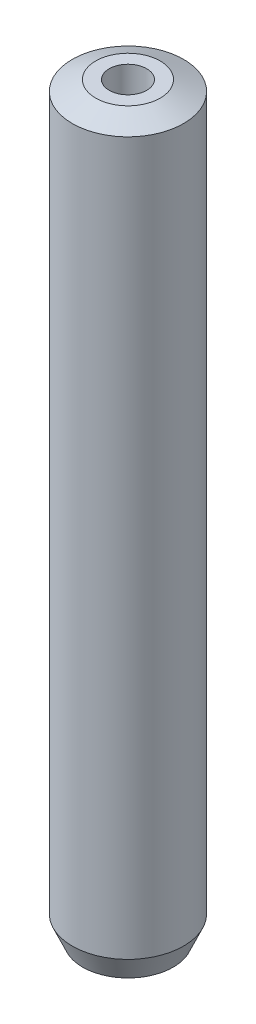
ISO-10303-21;
HEADER;
FILE_DESCRIPTION(('STEP AP214'),'2;1');
FILE_NAME('part.step','',(''),(''),'','','');
FILE_SCHEMA(('AUTOMOTIVE_DESIGN { 1 0 10303 214 1 1 1 1 }'));
ENDSEC;
DATA;
#1=APPLICATION_CONTEXT('core data for automotive mechanical design processes');
#2=APPLICATION_PROTOCOL_DEFINITION('international standard','automotive_design',2000,#1);
#3=PRODUCT_CONTEXT('',#1,'mechanical');
#4=PRODUCT('Part','Part','',(#3));
#5=PRODUCT_RELATED_PRODUCT_CATEGORY('part','',(#4));
#6=PRODUCT_DEFINITION_FORMATION('','',#4);
#7=PRODUCT_DEFINITION_CONTEXT('part definition',#1,'design');
#8=PRODUCT_DEFINITION('design','',#6,#7);
#9=PRODUCT_DEFINITION_SHAPE('','',#8);
#10=(LENGTH_UNIT() NAMED_UNIT(*) SI_UNIT(.MILLI.,.METRE.));
#11=(NAMED_UNIT(*) PLANE_ANGLE_UNIT() SI_UNIT($,.RADIAN.));
#12=(NAMED_UNIT(*) SI_UNIT($,.STERADIAN.) SOLID_ANGLE_UNIT());
#13=UNCERTAINTY_MEASURE_WITH_UNIT(LENGTH_MEASURE(1.E-05),#10,'distance_accuracy_value','');
#14=(GEOMETRIC_REPRESENTATION_CONTEXT(3) GLOBAL_UNCERTAINTY_ASSIGNED_CONTEXT((#13)) GLOBAL_UNIT_ASSIGNED_CONTEXT((#10,
#11,#12)) REPRESENTATION_CONTEXT('',''));
#15=CARTESIAN_POINT('',(0.,0.,0.));
#16=DIRECTION('',(0.,0.,1.));
#17=DIRECTION('',(1.,0.,0.));
#18=AXIS2_PLACEMENT_3D('',#15,#16,#17);
#19=CARTESIAN_POINT('',(0.,201.104191987533,0.));
#20=DIRECTION('',(0.,-1.,0.));
#21=DIRECTION('',(0.,0.,-1.));
#22=AXIS2_PLACEMENT_3D('',#19,#20,#21);
#23=CYLINDRICAL_SURFACE('',#22,15.);
#24=CARTESIAN_POINT('',(0.,198.325708868817,0.));
#25=DIRECTION('',(0.,1.,0.));
#26=DIRECTION('',(0.,0.,1.));
#27=AXIS2_PLACEMENT_3D('',#24,#25,#26);
#28=CIRCLE('',#27,15.);
#29=CARTESIAN_POINT('',(0.,198.325708868817,15.));
#30=VERTEX_POINT('',#29);
#31=EDGE_CURVE('E50',#30,#30,#28,.F.);
#32=ORIENTED_EDGE('',*,*,#31,.T.);
#33=EDGE_LOOP('',(#32));
#34=FACE_BOUND('',#33,.T.);
#35=CARTESIAN_POINT('',(0.,6.31350959814106,0.));
#36=DIRECTION('',(0.,1.,0.));
#37=DIRECTION('',(0.,0.,1.));
#38=AXIS2_PLACEMENT_3D('',#35,#36,#37);
#39=CIRCLE('',#38,15.);
#40=CARTESIAN_POINT('',(0.,6.31350959814106,15.));
#41=VERTEX_POINT('',#40);
#42=EDGE_CURVE('E51',#41,#41,#39,.T.);
#43=ORIENTED_EDGE('',*,*,#42,.T.);
#44=EDGE_LOOP('',(#43));
#45=FACE_BOUND('',#44,.T.);
#46=ADVANCED_FACE('F39',(#34,#45),#23,.T.);
#47=CARTESIAN_POINT('',(0.,201.104191987533,0.));
#48=DIRECTION('',(0.,1.,0.));
#49=DIRECTION('',(0.,0.,1.));
#50=AXIS2_PLACEMENT_3D('',#47,#48,#49);
#51=PLANE('',#50);
#52=CARTESIAN_POINT('',(0.,201.104191987533,0.));
#53=DIRECTION('',(0.,1.,0.));
#54=DIRECTION('',(0.,0.,1.));
#55=AXIS2_PLACEMENT_3D('',#52,#53,#54);
#56=CIRCLE('',#55,8.68649040185884);
#57=CARTESIAN_POINT('',(0.,201.104191987533,8.68649040185884));
#58=VERTEX_POINT('',#57);
#59=EDGE_CURVE('E54',#58,#58,#56,.T.);
#60=ORIENTED_EDGE('',*,*,#59,.T.);
#61=EDGE_LOOP('',(#60));
#62=FACE_BOUND('',#61,.T.);
#63=CARTESIAN_POINT('',(0.,201.104191987533,0.));
#64=DIRECTION('',(0.,1.,0.));
#65=DIRECTION('',(0.,0.,1.));
#66=AXIS2_PLACEMENT_3D('',#63,#64,#65);
#67=CIRCLE('',#66,5.05595798208887);
#68=CARTESIAN_POINT('',(0.,201.104191987533,5.05595798208887));
#69=VERTEX_POINT('',#68);
#70=EDGE_CURVE('E58',#69,#69,#67,.T.);
#71=ORIENTED_EDGE('',*,*,#70,.F.);
#72=EDGE_LOOP('',(#71));
#73=FACE_BOUND('',#72,.T.);
#74=ADVANCED_FACE('F69',(#62,#73),#51,.T.);
#75=CARTESIAN_POINT('',(0.,0.,0.));
#76=DIRECTION('',(0.,1.,0.));
#77=DIRECTION('',(0.,0.,1.));
#78=AXIS2_PLACEMENT_3D('',#75,#76,#77);
#79=PLANE('',#78);
#80=CARTESIAN_POINT('',(0.,0.,0.));
#81=DIRECTION('',(0.,1.,0.));
#82=DIRECTION('',(0.,0.,1.));
#83=AXIS2_PLACEMENT_3D('',#80,#81,#82);
#84=CIRCLE('',#83,12.221516881284);
#85=CARTESIAN_POINT('',(0.,0.,12.221516881284));
#86=VERTEX_POINT('',#85);
#87=EDGE_CURVE('E10',#86,#86,#84,.F.);
#88=ORIENTED_EDGE('',*,*,#87,.T.);
#89=EDGE_LOOP('',(#88));
#90=FACE_BOUND('',#89,.T.);
#91=CARTESIAN_POINT('',(0.,0.,0.));
#92=DIRECTION('',(0.,1.,0.));
#93=DIRECTION('',(0.,0.,1.));
#94=AXIS2_PLACEMENT_3D('',#91,#92,#93);
#95=CIRCLE('',#94,5.05595798208887);
#96=CARTESIAN_POINT('',(0.,0.,5.05595798208887));
#97=VERTEX_POINT('',#96);
#98=EDGE_CURVE('E63',#97,#97,#95,.T.);
#99=ORIENTED_EDGE('',*,*,#98,.T.);
#100=EDGE_LOOP('',(#99));
#101=FACE_BOUND('',#100,.T.);
#102=ADVANCED_FACE('F75',(#90,#101),#79,.F.);
#103=CARTESIAN_POINT('',(0.,201.104191987533,0.));
#104=DIRECTION('',(0.,-1.,0.));
#105=DIRECTION('',(0.,0.,-1.));
#106=AXIS2_PLACEMENT_3D('',#103,#104,#105);
#107=CYLINDRICAL_SURFACE('',#106,5.05595798208887);
#108=ORIENTED_EDGE('',*,*,#70,.T.);
#109=EDGE_LOOP('',(#108));
#110=FACE_BOUND('',#109,.T.);
#111=ORIENTED_EDGE('',*,*,#98,.F.);
#112=EDGE_LOOP('',(#111));
#113=FACE_BOUND('',#112,.T.);
#114=ADVANCED_FACE('F70',(#110,#113),#107,.F.);
#115=CARTESIAN_POINT('',(0.,201.104191987533,0.));
#116=DIRECTION('',(0.,-1.,0.));
#117=DIRECTION('',(0.,0.,-1.));
#118=AXIS2_PLACEMENT_3D('',#115,#116,#117);
#119=CONICAL_SURFACE('',#118,8.68649040185884,1.15621794311809);
#120=ORIENTED_EDGE('',*,*,#31,.F.);
#121=EDGE_LOOP('',(#120));
#122=FACE_BOUND('',#121,.T.);
#123=ORIENTED_EDGE('',*,*,#59,.F.);
#124=EDGE_LOOP('',(#123));
#125=FACE_BOUND('',#124,.T.);
#126=ADVANCED_FACE('F81',(#122,#125),#119,.T.);
#127=CARTESIAN_POINT('',(0.,6.31350959814106,0.));
#128=DIRECTION('',(0.,1.,0.));
#129=DIRECTION('',(0.,0.,1.));
#130=AXIS2_PLACEMENT_3D('',#127,#128,#129);
#131=CONICAL_SURFACE('',#130,15.,0.414578383676809);
#132=CARTESIAN_POINT('',(0.,0.,12.221516881284));
#133=CARTESIAN_POINT('',(0.,0.0657657249806359,12.2504594137706));
#134=CARTESIAN_POINT('',(0.,0.131531449961272,12.2794019462572));
#135=CARTESIAN_POINT('',(0.,0.263062899922543,12.3372870112305));
#136=CARTESIAN_POINT('',(0.,0.328828624903179,12.3662295437171));
#137=CARTESIAN_POINT('',(0.,0.460360074864451,12.4241146086903));
#138=CARTESIAN_POINT('',(0.,0.526125799845088,12.453057141177));
#139=CARTESIAN_POINT('',(0.,0.65765724980636,12.5109422061502));
#140=CARTESIAN_POINT('',(0.,0.723422974786995,12.5398847386368));
#141=CARTESIAN_POINT('',(0.,0.854954424748267,12.5977698036101));
#142=CARTESIAN_POINT('',(0.,0.920720149728904,12.6267123360967));
#143=CARTESIAN_POINT('',(0.,1.05225159969018,12.68459740107));
#144=CARTESIAN_POINT('',(0.,1.11801732467081,12.7135399335566));
#145=CARTESIAN_POINT('',(0.,1.24954877463208,12.7714249985298));
#146=CARTESIAN_POINT('',(0.,1.31531449961272,12.8003675310165));
#147=CARTESIAN_POINT('',(0.,1.44684594957399,12.8582525959897));
#148=CARTESIAN_POINT('',(0.,1.51261167455463,12.8871951284763));
#149=CARTESIAN_POINT('',(0.,1.6441431245159,12.9450801934496));
#150=CARTESIAN_POINT('',(0.,1.70990884949654,12.9740227259362));
#151=CARTESIAN_POINT('',(0.,1.84144029945781,13.0319077909095));
#152=CARTESIAN_POINT('',(0.,1.90720602443844,13.0608503233961));
#153=CARTESIAN_POINT('',(0.,2.03873747439972,13.1187353883694));
#154=CARTESIAN_POINT('',(0.,2.10450319938035,13.147677920856));
#155=CARTESIAN_POINT('',(0.,2.23603464934162,13.2055629858292));
#156=CARTESIAN_POINT('',(0.,2.30180037432226,13.2345055183159));
#157=CARTESIAN_POINT('',(0.,2.43333182428353,13.2923905832891));
#158=CARTESIAN_POINT('',(0.,2.49909754926417,13.3213331157757));
#159=CARTESIAN_POINT('',(0.,2.63062899922544,13.379218180749));
#160=CARTESIAN_POINT('',(0.,2.69639472420608,13.4081607132356));
#161=CARTESIAN_POINT('',(0.,2.82792617416735,13.4660457782089));
#162=CARTESIAN_POINT('',(0.,2.89369189914798,13.4949883106955));
#163=CARTESIAN_POINT('',(0.,3.02522334910926,13.5528733756687));
#164=CARTESIAN_POINT('',(0.,3.09098907408989,13.5818159081554));
#165=CARTESIAN_POINT('',(0.,3.22252052405116,13.6397009731286));
#166=CARTESIAN_POINT('',(0.,3.2882862490318,13.6686435056152));
#167=CARTESIAN_POINT('',(0.,3.41981769899307,13.7265285705885));
#168=CARTESIAN_POINT('',(0.,3.48558342397371,13.7554711030751));
#169=CARTESIAN_POINT('',(0.,3.61711487393498,13.8133561680484));
#170=CARTESIAN_POINT('',(0.,3.68288059891562,13.842298700535));
#171=CARTESIAN_POINT('',(0.,3.81441204887689,13.9001837655082));
#172=CARTESIAN_POINT('',(0.,3.88017777385753,13.9291262979949));
#173=CARTESIAN_POINT('',(0.,4.0117092238188,13.9870113629681));
#174=CARTESIAN_POINT('',(0.,4.07747494879943,14.0159538954547));
#175=CARTESIAN_POINT('',(0.,4.20900639876071,14.073838960428));
#176=CARTESIAN_POINT('',(0.,4.27477212374134,14.1027814929146));
#177=CARTESIAN_POINT('',(0.,4.40630357370261,14.1606665578879));
#178=CARTESIAN_POINT('',(0.,4.47206929868325,14.1896090903745));
#179=CARTESIAN_POINT('',(0.,4.60360074864452,14.2474941553477));
#180=CARTESIAN_POINT('',(0.,4.66936647362516,14.2764366878344));
#181=CARTESIAN_POINT('',(0.,4.80089792358643,14.3343217528076));
#182=CARTESIAN_POINT('',(0.,4.86666364856707,14.3632642852942));
#183=CARTESIAN_POINT('',(0.,4.99819509852834,14.4211493502675));
#184=CARTESIAN_POINT('',(0.,5.06396082350897,14.4500918827541));
#185=CARTESIAN_POINT('',(0.,5.19549227347025,14.5079769477274));
#186=CARTESIAN_POINT('',(0.,5.26125799845088,14.536919480214));
#187=CARTESIAN_POINT('',(0.,5.39278944841215,14.5948045451872));
#188=CARTESIAN_POINT('',(0.,5.45855517339279,14.6237470776739));
#189=CARTESIAN_POINT('',(0.,5.59008662335406,14.6816321426471));
#190=CARTESIAN_POINT('',(0.,5.6558523483347,14.7105746751337));
#191=CARTESIAN_POINT('',(0.,5.78738379829597,14.768459740107));
#192=CARTESIAN_POINT('',(0.,5.85314952327661,14.7974022725936));
#193=CARTESIAN_POINT('',(0.,5.98468097323788,14.8552873375669));
#194=CARTESIAN_POINT('',(0.,6.05044669821851,14.8842298700535));
#195=CARTESIAN_POINT('',(0.,6.18197814817979,14.9421149350267));
#196=CARTESIAN_POINT('',(0.,6.24774387316042,14.9710574675134));
#197=CARTESIAN_POINT('',(0.,6.31350959814106,15.));
#198=B_SPLINE_CURVE_WITH_KNOTS('',3,(#132,#133,#134,#135,#136,#137,#138,#139,#140,#141,#142,
#143,#144,#145,#146,#147,#148,#149,#150,#151,#152,#153,#154,#155,#156,#157,#158,#159,#160,#161,
#162,#163,#164,#165,#166,#167,#168,#169,#170,#171,#172,#173,#174,#175,#176,#177,#178,#179,#180,
#181,#182,#183,#184,#185,#186,#187,#188,#189,#190,#191,#192,#193,#194,#195,#196,#197),
.UNSPECIFIED.,.F.,.F.,(4,2,2,2,2,2,2,2,2,2,2,2,2,2,2,2,2,2,2,2,2,2,2,2,2,2,2,2,2,2,2,2,4),(0.,
0.215557896911043,0.431115793822088,0.646673690733131,0.862231587644175,1.07778948455522,
1.29334738146626,1.50890527837731,1.72446317528835,1.94002107219939,2.15557896911044,
2.37113686602148,2.58669476293253,2.80225265984357,3.01781055675461,3.23336845366566,
3.4489263505767,3.66448424748774,3.88004214439879,4.09560004130983,4.31115793822088,
4.52671583513192,4.74227373204296,4.957831628954,5.17338952586505,5.38894742277609,
5.60450531968714,5.82006321659818,6.03562111350922,6.25117901042027,6.46673690733131,
6.68229480424235,6.8978527011534),.UNSPECIFIED.);
#199=EDGE_CURVE('BSEAM45',#86,#41,#198,.T.);
#200=ORIENTED_EDGE('',*,*,#87,.F.);
#201=ORIENTED_EDGE('',*,*,#42,.F.);
#202=ORIENTED_EDGE('',*,*,#199,.T.);
#203=ORIENTED_EDGE('',*,*,#199,.F.);
#204=EDGE_LOOP('',(#200,#202,#201,#203));
#205=FACE_BOUND('',#204,.T.);
#206=ADVANCED_FACE('F45',(#205),#131,.T.);
#207=CLOSED_SHELL('',(#46,#74,#102,#114,#126,#206));
#208=MANIFOLD_SOLID_BREP('B2',#207);
#209=ADVANCED_BREP_SHAPE_REPRESENTATION('',(#18,#208),#14);
#210=SHAPE_DEFINITION_REPRESENTATION(#9,#209);
ENDSEC;
END-ISO-10303-21;
